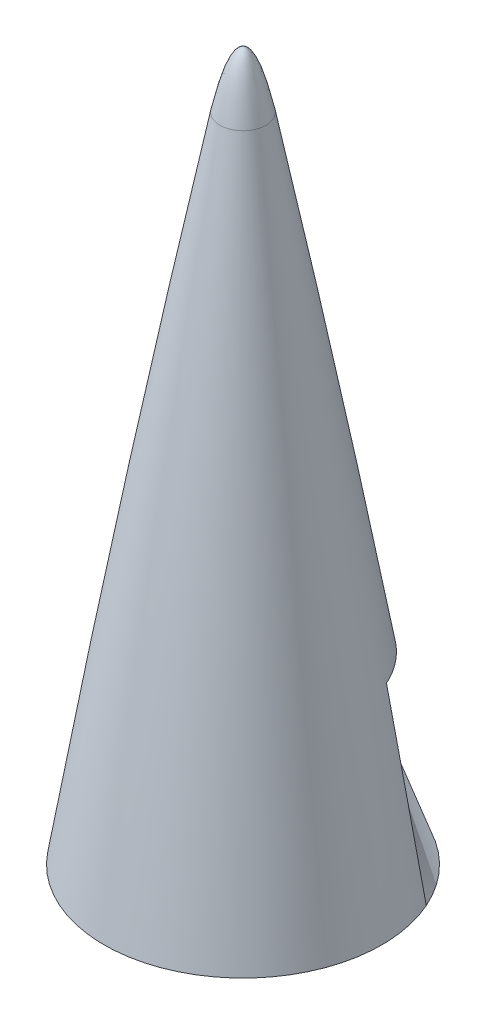
ISO-10303-21;
HEADER;
FILE_DESCRIPTION(('STEP AP214'),'2;1');
FILE_NAME('part.step','',(''),(''),'','','');
FILE_SCHEMA(('AUTOMOTIVE_DESIGN { 1 0 10303 214 1 1 1 1 }'));
ENDSEC;
DATA;
#1=APPLICATION_CONTEXT('core data for automotive mechanical design processes');
#2=APPLICATION_PROTOCOL_DEFINITION('international standard','automotive_design',2000,#1);
#3=PRODUCT_CONTEXT('',#1,'mechanical');
#4=PRODUCT('Part','Part','',(#3));
#5=PRODUCT_RELATED_PRODUCT_CATEGORY('part','',(#4));
#6=PRODUCT_DEFINITION_FORMATION('','',#4);
#7=PRODUCT_DEFINITION_CONTEXT('part definition',#1,'design');
#8=PRODUCT_DEFINITION('design','',#6,#7);
#9=PRODUCT_DEFINITION_SHAPE('','',#8);
#10=(LENGTH_UNIT() NAMED_UNIT(*) SI_UNIT(.MILLI.,.METRE.));
#11=(NAMED_UNIT(*) PLANE_ANGLE_UNIT() SI_UNIT($,.RADIAN.));
#12=(NAMED_UNIT(*) SI_UNIT($,.STERADIAN.) SOLID_ANGLE_UNIT());
#13=UNCERTAINTY_MEASURE_WITH_UNIT(LENGTH_MEASURE(1.E-05),#10,'distance_accuracy_value','');
#14=(GEOMETRIC_REPRESENTATION_CONTEXT(3) GLOBAL_UNCERTAINTY_ASSIGNED_CONTEXT((#13)) GLOBAL_UNIT_ASSIGNED_CONTEXT((#10,
#11,#12)) REPRESENTATION_CONTEXT('',''));
#15=CARTESIAN_POINT('',(0.,0.,0.));
#16=DIRECTION('',(0.,0.,1.));
#17=DIRECTION('',(1.,0.,0.));
#18=AXIS2_PLACEMENT_3D('',#15,#16,#17);
#19=CARTESIAN_POINT('',(-3.5527136788005E-12,1.80102599500742E-08,0.));
#20=DIRECTION('',(0.,1.,0.));
#21=DIRECTION('',(-1.,0.,0.));
#22=AXIS2_PLACEMENT_3D('',#19,#20,#21);
#23=DEGENERATE_TOROIDAL_SURFACE('',#22,5029.19999990055,5130.79999989884,.F.);
#24=CARTESIAN_POINT('',(0.,812.800000000069,0.));
#25=DIRECTION('',(0.,1.,0.));
#26=DIRECTION('',(-1.,0.,0.));
#27=AXIS2_PLACEMENT_3D('',#24,#25,#26);
#28=CIRCLE('',#27,36.8107382434125);
#29=CARTESIAN_POINT('',(-36.8107382434125,812.80000000007,0.));
#30=VERTEX_POINT('',#29);
#31=EDGE_CURVE('E11',#30,#30,#28,.T.);
#32=ORIENTED_EDGE('',*,*,#31,.T.);
#33=EDGE_LOOP('',(#32));
#34=FACE_BOUND('',#33,.T.);
#35=CARTESIAN_POINT('',(0.,985.4578151198,0.));
#36=DIRECTION('',(0.,-1.,0.));
#37=DIRECTION('',(0.,0.,-1.));
#38=AXIS2_PLACEMENT_3D('',#35,#36,#37);
#39=CIRCLE('',#38,6.07372985997312);
#40=CARTESIAN_POINT('',(0.,985.4578151198,-6.07372985997312));
#41=VERTEX_POINT('',#40);
#42=EDGE_CURVE('E40',#41,#41,#39,.T.);
#43=ORIENTED_EDGE('',*,*,#42,.T.);
#44=EDGE_LOOP('',(#43));
#45=FACE_BOUND('',#44,.T.);
#46=ADVANCED_FACE('F34',(#34,#45),#23,.F.);
#47=CARTESIAN_POINT('',(0.,812.800000000035,0.));
#48=DIRECTION('',(0.,-1.,0.));
#49=DIRECTION('',(1.,0.,0.));
#50=AXIS2_PLACEMENT_3D('',#47,#48,#49);
#51=PLANE('',#50);
#52=ORIENTED_EDGE('',*,*,#31,.F.);
#53=EDGE_LOOP('',(#52));
#54=FACE_BOUND('',#53,.T.);
#55=ADVANCED_FACE('F46',(#54),#51,.T.);
#56=CARTESIAN_POINT('',(0.,985.4578151198,-6.07372985997312));
#57=CARTESIAN_POINT('',(0.,1000.33869195154,-3.0131966552106));
#58=CARTESIAN_POINT('',(0.,1000.3224787326,0.));
#59=B_SPLINE_CURVE_WITH_KNOTS('',2,(#56,#57,#58),.UNSPECIFIED.,.F.,.F.,(3,3),(0.,
0.500461160030229),.UNSPECIFIED.);
#60=CARTESIAN_POINT('',(0.,985.4578151198,0.));
#61=DIRECTION('',(0.,-1.,0.));
#62=AXIS1_PLACEMENT('',#60,#61);
#63=SURFACE_OF_REVOLUTION('',#59,#62);
#64=CARTESIAN_POINT('',(0.,1000.3224787326,0.));
#65=VERTEX_POINT('',#64);
#66=VERTEX_LOOP('',#65);
#67=FACE_BOUND('',#66,.T.);
#68=ORIENTED_EDGE('',*,*,#42,.F.);
#69=EDGE_LOOP('',(#68));
#70=FACE_BOUND('',#69,.T.);
#71=ADVANCED_FACE('F43',(#67,#70),#63,.F.);
#72=CLOSED_SHELL('',(#46,#55,#71));
#73=MANIFOLD_SOLID_BREP('B2',#72);
#74=ADVANCED_BREP_SHAPE_REPRESENTATION('',(#18,#73),#14);
#75=SHAPE_DEFINITION_REPRESENTATION(#9,#74);
ENDSEC;
END-ISO-10303-21;
